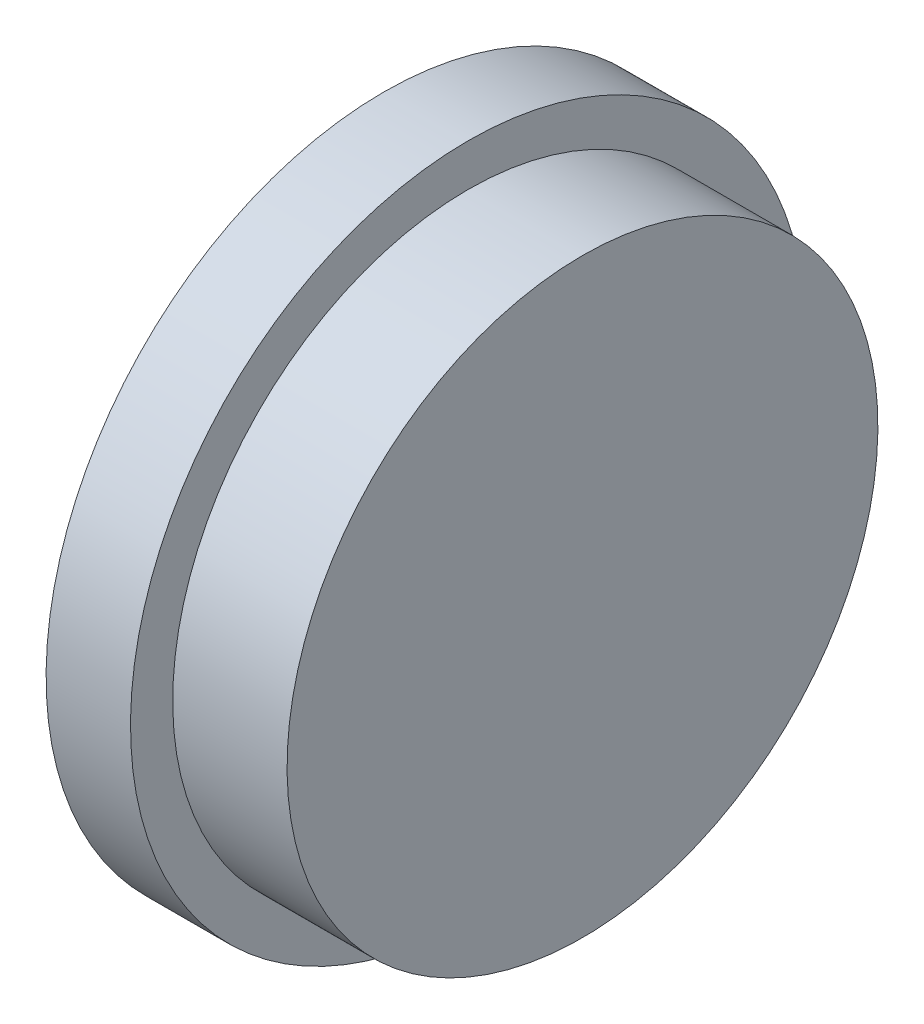
ISO-10303-21;
HEADER;
FILE_DESCRIPTION(('STEP AP214'),'2;1');
FILE_NAME('part.step','',(''),(''),'','','');
FILE_SCHEMA(('AUTOMOTIVE_DESIGN { 1 0 10303 214 1 1 1 1 }'));
ENDSEC;
DATA;
#1=APPLICATION_CONTEXT('core data for automotive mechanical design processes');
#2=APPLICATION_PROTOCOL_DEFINITION('international standard','automotive_design',2000,#1);
#3=PRODUCT_CONTEXT('',#1,'mechanical');
#4=PRODUCT('Part','Part','',(#3));
#5=PRODUCT_RELATED_PRODUCT_CATEGORY('part','',(#4));
#6=PRODUCT_DEFINITION_FORMATION('','',#4);
#7=PRODUCT_DEFINITION_CONTEXT('part definition',#1,'design');
#8=PRODUCT_DEFINITION('design','',#6,#7);
#9=PRODUCT_DEFINITION_SHAPE('','',#8);
#10=(LENGTH_UNIT() NAMED_UNIT(*) SI_UNIT(.MILLI.,.METRE.));
#11=(NAMED_UNIT(*) PLANE_ANGLE_UNIT() SI_UNIT($,.RADIAN.));
#12=(NAMED_UNIT(*) SI_UNIT($,.STERADIAN.) SOLID_ANGLE_UNIT());
#13=UNCERTAINTY_MEASURE_WITH_UNIT(LENGTH_MEASURE(1.E-05),#10,'distance_accuracy_value','');
#14=(GEOMETRIC_REPRESENTATION_CONTEXT(3) GLOBAL_UNCERTAINTY_ASSIGNED_CONTEXT((#13)) GLOBAL_UNIT_ASSIGNED_CONTEXT((#10,
#11,#12)) REPRESENTATION_CONTEXT('',''));
#15=CARTESIAN_POINT('',(0.,0.,0.));
#16=DIRECTION('',(0.,0.,1.));
#17=DIRECTION('',(1.,0.,0.));
#18=AXIS2_PLACEMENT_3D('',#15,#16,#17);
#19=CARTESIAN_POINT('',(0.870967741935463,16.,0.));
#20=DIRECTION('',(-1.,0.,0.));
#21=DIRECTION('',(0.,-1.,0.));
#22=AXIS2_PLACEMENT_3D('',#19,#20,#21);
#23=PLANE('',#22);
#24=CARTESIAN_POINT('',(0.870967741935463,0.,0.));
#25=DIRECTION('',(1.,0.,0.));
#26=DIRECTION('',(0.,1.,0.));
#27=AXIS2_PLACEMENT_3D('',#24,#25,#26);
#28=CIRCLE('',#27,16.);
#29=CARTESIAN_POINT('',(0.870967741935463,16.,0.));
#30=VERTEX_POINT('',#29);
#31=EDGE_CURVE('E57',#30,#30,#28,.T.);
#32=ORIENTED_EDGE('',*,*,#31,.T.);
#33=EDGE_LOOP('',(#32));
#34=FACE_BOUND('',#33,.T.);
#35=CARTESIAN_POINT('',(0.870967741935463,0.,0.));
#36=DIRECTION('',(1.,0.,0.));
#37=DIRECTION('',(0.,1.,0.));
#38=AXIS2_PLACEMENT_3D('',#35,#36,#37);
#39=CIRCLE('',#38,24.);
#40=CARTESIAN_POINT('',(0.870967741935463,24.,0.));
#41=VERTEX_POINT('',#40);
#42=EDGE_CURVE('E10',#41,#41,#39,.T.);
#43=ORIENTED_EDGE('',*,*,#42,.F.);
#44=EDGE_LOOP('',(#43));
#45=FACE_BOUND('',#44,.T.);
#46=ADVANCED_FACE('F35',(#34,#45),#23,.T.);
#47=CARTESIAN_POINT('',(13.,0.,0.));
#48=DIRECTION('',(1.,0.,0.));
#49=DIRECTION('',(0.,1.,0.));
#50=AXIS2_PLACEMENT_3D('',#47,#48,#49);
#51=CYLINDRICAL_SURFACE('',#50,24.);
#52=ORIENTED_EDGE('',*,*,#42,.T.);
#53=EDGE_LOOP('',(#52));
#54=FACE_BOUND('',#53,.T.);
#55=CARTESIAN_POINT('',(6.87096774193546,0.,0.));
#56=DIRECTION('',(1.,0.,0.));
#57=DIRECTION('',(0.,1.,0.));
#58=AXIS2_PLACEMENT_3D('',#55,#56,#57);
#59=CIRCLE('',#58,24.);
#60=CARTESIAN_POINT('',(6.87096774193546,24.,0.));
#61=VERTEX_POINT('',#60);
#62=EDGE_CURVE('E41',#61,#61,#59,.T.);
#63=ORIENTED_EDGE('',*,*,#62,.F.);
#64=EDGE_LOOP('',(#63));
#65=FACE_BOUND('',#64,.T.);
#66=ADVANCED_FACE('F75',(#54,#65),#51,.T.);
#67=CARTESIAN_POINT('',(6.87096774193546,24.,0.));
#68=DIRECTION('',(1.,0.,0.));
#69=DIRECTION('',(0.,1.,0.));
#70=AXIS2_PLACEMENT_3D('',#67,#68,#69);
#71=PLANE('',#70);
#72=ORIENTED_EDGE('',*,*,#62,.T.);
#73=EDGE_LOOP('',(#72));
#74=FACE_BOUND('',#73,.T.);
#75=CARTESIAN_POINT('',(6.87096774193546,0.,0.));
#76=DIRECTION('',(1.,0.,0.));
#77=DIRECTION('',(0.,1.,0.));
#78=AXIS2_PLACEMENT_3D('',#75,#76,#77);
#79=CIRCLE('',#78,21.);
#80=CARTESIAN_POINT('',(6.87096774193546,21.,0.));
#81=VERTEX_POINT('',#80);
#82=EDGE_CURVE('E45',#81,#81,#79,.T.);
#83=ORIENTED_EDGE('',*,*,#82,.F.);
#84=EDGE_LOOP('',(#83));
#85=FACE_BOUND('',#84,.T.);
#86=ADVANCED_FACE('F79',(#74,#85),#71,.T.);
#87=CARTESIAN_POINT('',(13.,0.,0.));
#88=DIRECTION('',(1.,0.,0.));
#89=DIRECTION('',(0.,1.,0.));
#90=AXIS2_PLACEMENT_3D('',#87,#88,#89);
#91=CYLINDRICAL_SURFACE('',#90,21.);
#92=ORIENTED_EDGE('',*,*,#82,.T.);
#93=EDGE_LOOP('',(#92));
#94=FACE_BOUND('',#93,.T.);
#95=CARTESIAN_POINT('',(15.,0.,0.));
#96=DIRECTION('',(1.,0.,0.));
#97=DIRECTION('',(0.,1.,0.));
#98=AXIS2_PLACEMENT_3D('',#95,#96,#97);
#99=CIRCLE('',#98,21.);
#100=CARTESIAN_POINT('',(15.,21.,0.));
#101=VERTEX_POINT('',#100);
#102=EDGE_CURVE('E49',#101,#101,#99,.T.);
#103=ORIENTED_EDGE('',*,*,#102,.F.);
#104=EDGE_LOOP('',(#103));
#105=FACE_BOUND('',#104,.T.);
#106=ADVANCED_FACE('F83',(#94,#105),#91,.T.);
#107=CARTESIAN_POINT('',(15.,21.,0.));
#108=DIRECTION('',(1.,0.,0.));
#109=DIRECTION('',(0.,1.,0.));
#110=AXIS2_PLACEMENT_3D('',#107,#108,#109);
#111=PLANE('',#110);
#112=ORIENTED_EDGE('',*,*,#102,.T.);
#113=EDGE_LOOP('',(#112));
#114=FACE_BOUND('',#113,.T.);
#115=ADVANCED_FACE('F71',(#114),#111,.T.);
#116=CARTESIAN_POINT('',(13.,0.,0.));
#117=DIRECTION('',(-1.,0.,0.));
#118=DIRECTION('',(0.,-1.,0.));
#119=AXIS2_PLACEMENT_3D('',#116,#117,#118);
#120=PLANE('',#119);
#121=CARTESIAN_POINT('',(13.,0.,0.));
#122=DIRECTION('',(1.,0.,0.));
#123=DIRECTION('',(0.,1.,0.));
#124=AXIS2_PLACEMENT_3D('',#121,#122,#123);
#125=CIRCLE('',#124,16.);
#126=CARTESIAN_POINT('',(13.,16.,0.));
#127=VERTEX_POINT('',#126);
#128=EDGE_CURVE('E54',#127,#127,#125,.T.);
#129=ORIENTED_EDGE('',*,*,#128,.F.);
#130=EDGE_LOOP('',(#129));
#131=FACE_BOUND('',#130,.T.);
#132=ADVANCED_FACE('F65',(#131),#120,.T.);
#133=CARTESIAN_POINT('',(13.,0.,0.));
#134=DIRECTION('',(1.,0.,0.));
#135=DIRECTION('',(0.,1.,0.));
#136=AXIS2_PLACEMENT_3D('',#133,#134,#135);
#137=CYLINDRICAL_SURFACE('',#136,16.);
#138=ORIENTED_EDGE('',*,*,#128,.T.);
#139=EDGE_LOOP('',(#138));
#140=FACE_BOUND('',#139,.T.);
#141=ORIENTED_EDGE('',*,*,#31,.F.);
#142=EDGE_LOOP('',(#141));
#143=FACE_BOUND('',#142,.T.);
#144=ADVANCED_FACE('F63',(#140,#143),#137,.F.);
#145=CLOSED_SHELL('',(#46,#66,#86,#106,#115,#132,#144));
#146=MANIFOLD_SOLID_BREP('B2',#145);
#147=ADVANCED_BREP_SHAPE_REPRESENTATION('',(#18,#146),#14);
#148=SHAPE_DEFINITION_REPRESENTATION(#9,#147);
ENDSEC;
END-ISO-10303-21;
